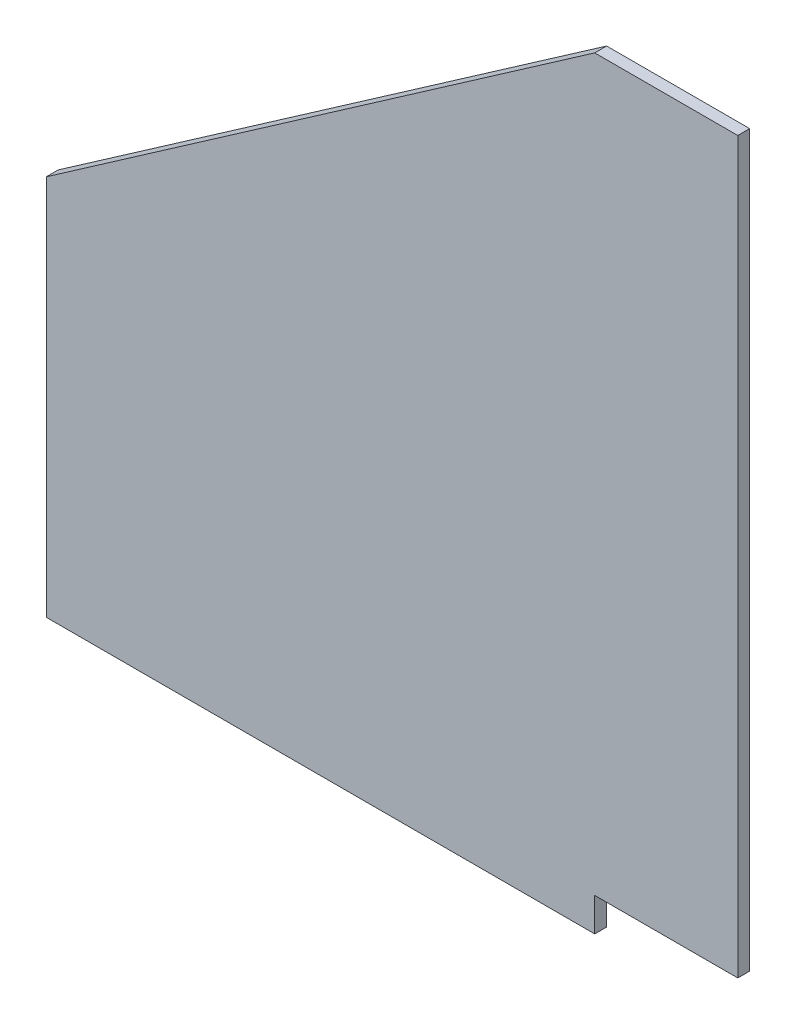
ISO-10303-21;
HEADER;
FILE_DESCRIPTION(('STEP AP214'),'2;1');
FILE_NAME('part.step','',(''),(''),'','','');
FILE_SCHEMA(('AUTOMOTIVE_DESIGN { 1 0 10303 214 1 1 1 1 }'));
ENDSEC;
DATA;
#1=APPLICATION_CONTEXT('core data for automotive mechanical design processes');
#2=APPLICATION_PROTOCOL_DEFINITION('international standard','automotive_design',2000,#1);
#3=PRODUCT_CONTEXT('',#1,'mechanical');
#4=PRODUCT('Part','Part','',(#3));
#5=PRODUCT_RELATED_PRODUCT_CATEGORY('part','',(#4));
#6=PRODUCT_DEFINITION_FORMATION('','',#4);
#7=PRODUCT_DEFINITION_CONTEXT('part definition',#1,'design');
#8=PRODUCT_DEFINITION('design','',#6,#7);
#9=PRODUCT_DEFINITION_SHAPE('','',#8);
#10=(LENGTH_UNIT() NAMED_UNIT(*) SI_UNIT(.MILLI.,.METRE.));
#11=(NAMED_UNIT(*) PLANE_ANGLE_UNIT() SI_UNIT($,.RADIAN.));
#12=(NAMED_UNIT(*) SI_UNIT($,.STERADIAN.) SOLID_ANGLE_UNIT());
#13=UNCERTAINTY_MEASURE_WITH_UNIT(LENGTH_MEASURE(1.E-05),#10,'distance_accuracy_value','');
#14=(GEOMETRIC_REPRESENTATION_CONTEXT(3) GLOBAL_UNCERTAINTY_ASSIGNED_CONTEXT((#13)) GLOBAL_UNIT_ASSIGNED_CONTEXT((#10,
#11,#12)) REPRESENTATION_CONTEXT('',''));
#15=CARTESIAN_POINT('',(0.,0.,0.));
#16=DIRECTION('',(0.,0.,1.));
#17=DIRECTION('',(1.,0.,0.));
#18=AXIS2_PLACEMENT_3D('',#15,#16,#17);
#19=CARTESIAN_POINT('',(-38.1,0.,3.175));
#20=DIRECTION('',(0.,1.,0.));
#21=DIRECTION('',(0.,0.,1.));
#22=AXIS2_PLACEMENT_3D('',#19,#20,#21);
#23=PLANE('',#22);
#24=DIRECTION('',(1.,0.,0.));
#25=VECTOR('',#24,1.);
#26=CARTESIAN_POINT('',(-38.1,0.,0.));
#27=LINE('',#26,#25);
#28=CARTESIAN_POINT('',(-38.1,0.,0.));
#29=VERTEX_POINT('',#28);
#30=CARTESIAN_POINT('',(0.,0.,0.));
#31=VERTEX_POINT('',#30);
#32=EDGE_CURVE('E128',#29,#31,#27,.T.);
#33=ORIENTED_EDGE('',*,*,#32,.T.);
#34=DIRECTION('',(0.,0.,-1.));
#35=VECTOR('',#34,1.);
#36=CARTESIAN_POINT('',(0.,0.,3.175));
#37=LINE('',#36,#35);
#38=CARTESIAN_POINT('',(0.,0.,3.175));
#39=VERTEX_POINT('',#38);
#40=EDGE_CURVE('E11',#39,#31,#37,.T.);
#41=ORIENTED_EDGE('',*,*,#40,.F.);
#42=DIRECTION('',(1.,0.,0.));
#43=VECTOR('',#42,1.);
#44=CARTESIAN_POINT('',(-38.1,0.,3.175));
#45=LINE('',#44,#43);
#46=CARTESIAN_POINT('',(-38.1,0.,3.175));
#47=VERTEX_POINT('',#46);
#48=EDGE_CURVE('E140',#47,#39,#45,.T.);
#49=ORIENTED_EDGE('',*,*,#48,.F.);
#50=DIRECTION('',(0.,0.,-1.));
#51=VECTOR('',#50,1.);
#52=CARTESIAN_POINT('',(-38.1,0.,3.175));
#53=LINE('',#52,#51);
#54=EDGE_CURVE('E124',#47,#29,#53,.T.);
#55=ORIENTED_EDGE('',*,*,#54,.T.);
#56=EDGE_LOOP('',(#33,#41,#49,#55));
#57=FACE_BOUND('',#56,.T.);
#58=ADVANCED_FACE('F38',(#57),#23,.F.);
#59=CARTESIAN_POINT('',(0.,0.,3.175));
#60=DIRECTION('',(-1.,0.,0.));
#61=DIRECTION('',(0.,0.,1.));
#62=AXIS2_PLACEMENT_3D('',#59,#60,#61);
#63=PLANE('',#62);
#64=DIRECTION('',(0.,1.,0.));
#65=VECTOR('',#64,1.);
#66=CARTESIAN_POINT('',(0.,0.,0.));
#67=LINE('',#66,#65);
#68=CARTESIAN_POINT('',(0.,194.31,0.));
#69=VERTEX_POINT('',#68);
#70=EDGE_CURVE('E131',#31,#69,#67,.T.);
#71=ORIENTED_EDGE('',*,*,#70,.T.);
#72=DIRECTION('',(0.,0.,-1.));
#73=VECTOR('',#72,1.);
#74=CARTESIAN_POINT('',(0.,194.31,3.175));
#75=LINE('',#74,#73);
#76=CARTESIAN_POINT('',(0.,194.31,3.175));
#77=VERTEX_POINT('',#76);
#78=EDGE_CURVE('E46',#77,#69,#75,.T.);
#79=ORIENTED_EDGE('',*,*,#78,.F.);
#80=DIRECTION('',(0.,1.,0.));
#81=VECTOR('',#80,1.);
#82=CARTESIAN_POINT('',(0.,0.,3.175));
#83=LINE('',#82,#81);
#84=EDGE_CURVE('E94',#39,#77,#83,.T.);
#85=ORIENTED_EDGE('',*,*,#84,.F.);
#86=ORIENTED_EDGE('',*,*,#40,.T.);
#87=EDGE_LOOP('',(#71,#79,#85,#86));
#88=FACE_BOUND('',#87,.T.);
#89=ADVANCED_FACE('F165',(#88),#63,.F.);
#90=CARTESIAN_POINT('',(0.,194.31,3.175));
#91=DIRECTION('',(0.,-1.,0.));
#92=DIRECTION('',(0.,0.,-1.));
#93=AXIS2_PLACEMENT_3D('',#90,#91,#92);
#94=PLANE('',#93);
#95=DIRECTION('',(-1.,0.,0.));
#96=VECTOR('',#95,1.);
#97=CARTESIAN_POINT('',(0.,194.31,0.));
#98=LINE('',#97,#96);
#99=CARTESIAN_POINT('',(-38.1,194.31,0.));
#100=VERTEX_POINT('',#99);
#101=EDGE_CURVE('E133',#69,#100,#98,.T.);
#102=ORIENTED_EDGE('',*,*,#101,.T.);
#103=DIRECTION('',(0.,0.,-1.));
#104=VECTOR('',#103,1.);
#105=CARTESIAN_POINT('',(-38.1,194.31,3.175));
#106=LINE('',#105,#104);
#107=CARTESIAN_POINT('',(-38.1,194.31,3.175));
#108=VERTEX_POINT('',#107);
#109=EDGE_CURVE('E144',#108,#100,#106,.T.);
#110=ORIENTED_EDGE('',*,*,#109,.F.);
#111=DIRECTION('',(-1.,0.,0.));
#112=VECTOR('',#111,1.);
#113=CARTESIAN_POINT('',(0.,194.31,3.175));
#114=LINE('',#113,#112);
#115=EDGE_CURVE('E152',#77,#108,#114,.T.);
#116=ORIENTED_EDGE('',*,*,#115,.F.);
#117=ORIENTED_EDGE('',*,*,#78,.T.);
#118=EDGE_LOOP('',(#102,#110,#116,#117));
#119=FACE_BOUND('',#118,.T.);
#120=ADVANCED_FACE('F150',(#119),#94,.F.);
#121=CARTESIAN_POINT('',(-184.15,92.71,3.175));
#122=DIRECTION('',(0.5710644881986,-0.820905201785487,0.));
#123=DIRECTION('',(0.820905201785487,0.5710644881986,0.));
#124=AXIS2_PLACEMENT_3D('',#121,#122,#123);
#125=PLANE('',#124);
#126=DIRECTION('',(-0.820905201785487,-0.5710644881986,0.));
#127=VECTOR('',#126,1.);
#128=CARTESIAN_POINT('',(-184.15,92.71,0.));
#129=LINE('',#128,#127);
#130=CARTESIAN_POINT('',(-184.15,92.71,0.));
#131=VERTEX_POINT('',#130);
#132=EDGE_CURVE('E135',#100,#131,#129,.T.);
#133=ORIENTED_EDGE('',*,*,#132,.T.);
#134=DIRECTION('',(0.,0.,-1.));
#135=VECTOR('',#134,1.);
#136=CARTESIAN_POINT('',(-184.15,92.71,3.175));
#137=LINE('',#136,#135);
#138=CARTESIAN_POINT('',(-184.15,92.71,3.175));
#139=VERTEX_POINT('',#138);
#140=EDGE_CURVE('E119',#139,#131,#137,.T.);
#141=ORIENTED_EDGE('',*,*,#140,.F.);
#142=DIRECTION('',(-0.820905201785487,-0.5710644881986,0.));
#143=VECTOR('',#142,1.);
#144=CARTESIAN_POINT('',(-184.15,92.71,3.175));
#145=LINE('',#144,#143);
#146=EDGE_CURVE('E110',#108,#139,#145,.T.);
#147=ORIENTED_EDGE('',*,*,#146,.F.);
#148=ORIENTED_EDGE('',*,*,#109,.T.);
#149=EDGE_LOOP('',(#133,#141,#147,#148));
#150=FACE_BOUND('',#149,.T.);
#151=ADVANCED_FACE('F158',(#150),#125,.F.);
#152=CARTESIAN_POINT('',(-184.15,-8.88999999999997,3.175));
#153=DIRECTION('',(1.,0.,0.));
#154=DIRECTION('',(0.,0.,-1.));
#155=AXIS2_PLACEMENT_3D('',#152,#153,#154);
#156=PLANE('',#155);
#157=DIRECTION('',(0.,-1.,0.));
#158=VECTOR('',#157,1.);
#159=CARTESIAN_POINT('',(-184.15,-8.88999999999997,0.));
#160=LINE('',#159,#158);
#161=CARTESIAN_POINT('',(-184.15,-8.88999999999997,0.));
#162=VERTEX_POINT('',#161);
#163=EDGE_CURVE('E118',#131,#162,#160,.T.);
#164=ORIENTED_EDGE('',*,*,#163,.T.);
#165=DIRECTION('',(0.,0.,-1.));
#166=VECTOR('',#165,1.);
#167=CARTESIAN_POINT('',(-184.15,-8.88999999999997,3.175));
#168=LINE('',#167,#166);
#169=CARTESIAN_POINT('',(-184.15,-8.88999999999997,3.175));
#170=VERTEX_POINT('',#169);
#171=EDGE_CURVE('E115',#170,#162,#168,.T.);
#172=ORIENTED_EDGE('',*,*,#171,.F.);
#173=DIRECTION('',(0.,-1.,0.));
#174=VECTOR('',#173,1.);
#175=CARTESIAN_POINT('',(-184.15,-8.88999999999997,3.175));
#176=LINE('',#175,#174);
#177=EDGE_CURVE('E104',#139,#170,#176,.T.);
#178=ORIENTED_EDGE('',*,*,#177,.F.);
#179=ORIENTED_EDGE('',*,*,#140,.T.);
#180=EDGE_LOOP('',(#164,#172,#178,#179));
#181=FACE_BOUND('',#180,.T.);
#182=ADVANCED_FACE('F116',(#181),#156,.F.);
#183=CARTESIAN_POINT('',(-184.15,-8.88999999999997,3.175));
#184=DIRECTION('',(0.,1.,0.));
#185=DIRECTION('',(0.,0.,1.));
#186=AXIS2_PLACEMENT_3D('',#183,#184,#185);
#187=PLANE('',#186);
#188=DIRECTION('',(1.,0.,0.));
#189=VECTOR('',#188,1.);
#190=CARTESIAN_POINT('',(-184.15,-8.88999999999997,0.));
#191=LINE('',#190,#189);
#192=CARTESIAN_POINT('',(-38.1,-8.88999999999997,0.));
#193=VERTEX_POINT('',#192);
#194=EDGE_CURVE('E80',#162,#193,#191,.T.);
#195=ORIENTED_EDGE('',*,*,#194,.T.);
#196=DIRECTION('',(0.,0.,-1.));
#197=VECTOR('',#196,1.);
#198=CARTESIAN_POINT('',(-38.1,-8.88999999999997,3.175));
#199=LINE('',#198,#197);
#200=CARTESIAN_POINT('',(-38.1,-8.88999999999997,3.175));
#201=VERTEX_POINT('',#200);
#202=EDGE_CURVE('E120',#201,#193,#199,.T.);
#203=ORIENTED_EDGE('',*,*,#202,.F.);
#204=DIRECTION('',(1.,0.,0.));
#205=VECTOR('',#204,1.);
#206=CARTESIAN_POINT('',(-184.15,-8.88999999999997,3.175));
#207=LINE('',#206,#205);
#208=EDGE_CURVE('E108',#170,#201,#207,.T.);
#209=ORIENTED_EDGE('',*,*,#208,.F.);
#210=ORIENTED_EDGE('',*,*,#171,.T.);
#211=EDGE_LOOP('',(#195,#203,#209,#210));
#212=FACE_BOUND('',#211,.T.);
#213=ADVANCED_FACE('F122',(#212),#187,.F.);
#214=CARTESIAN_POINT('',(-38.1,-8.88999999999997,3.175));
#215=DIRECTION('',(-1.,0.,0.));
#216=DIRECTION('',(0.,0.,1.));
#217=AXIS2_PLACEMENT_3D('',#214,#215,#216);
#218=PLANE('',#217);
#219=DIRECTION('',(0.,1.,0.));
#220=VECTOR('',#219,1.);
#221=CARTESIAN_POINT('',(-38.1,-8.88999999999997,0.));
#222=LINE('',#221,#220);
#223=EDGE_CURVE('E86',#193,#29,#222,.T.);
#224=ORIENTED_EDGE('',*,*,#223,.T.);
#225=ORIENTED_EDGE('',*,*,#54,.F.);
#226=DIRECTION('',(0.,1.,0.));
#227=VECTOR('',#226,1.);
#228=CARTESIAN_POINT('',(-38.1,-8.88999999999997,3.175));
#229=LINE('',#228,#227);
#230=EDGE_CURVE('E54',#201,#47,#229,.T.);
#231=ORIENTED_EDGE('',*,*,#230,.F.);
#232=ORIENTED_EDGE('',*,*,#202,.T.);
#233=EDGE_LOOP('',(#224,#225,#231,#232));
#234=FACE_BOUND('',#233,.T.);
#235=ADVANCED_FACE('F179',(#234),#218,.F.);
#236=CARTESIAN_POINT('',(0.,0.,3.175));
#237=DIRECTION('',(0.,0.,1.));
#238=DIRECTION('',(1.,0.,0.));
#239=AXIS2_PLACEMENT_3D('',#236,#237,#238);
#240=PLANE('',#239);
#241=ORIENTED_EDGE('',*,*,#48,.T.);
#242=ORIENTED_EDGE('',*,*,#84,.T.);
#243=ORIENTED_EDGE('',*,*,#115,.T.);
#244=ORIENTED_EDGE('',*,*,#146,.T.);
#245=ORIENTED_EDGE('',*,*,#177,.T.);
#246=ORIENTED_EDGE('',*,*,#208,.T.);
#247=ORIENTED_EDGE('',*,*,#230,.T.);
#248=EDGE_LOOP('',(#241,#242,#243,#244,#245,#246,#247));
#249=FACE_BOUND('',#248,.T.);
#250=ADVANCED_FACE('F106',(#249),#240,.T.);
#251=CARTESIAN_POINT('',(0.,0.,0.));
#252=DIRECTION('',(0.,0.,1.));
#253=DIRECTION('',(1.,0.,0.));
#254=AXIS2_PLACEMENT_3D('',#251,#252,#253);
#255=PLANE('',#254);
#256=ORIENTED_EDGE('',*,*,#32,.F.);
#257=ORIENTED_EDGE('',*,*,#223,.F.);
#258=ORIENTED_EDGE('',*,*,#194,.F.);
#259=ORIENTED_EDGE('',*,*,#163,.F.);
#260=ORIENTED_EDGE('',*,*,#132,.F.);
#261=ORIENTED_EDGE('',*,*,#101,.F.);
#262=ORIENTED_EDGE('',*,*,#70,.F.);
#263=EDGE_LOOP('',(#256,#257,#258,#259,#260,#261,#262));
#264=FACE_BOUND('',#263,.T.);
#265=ADVANCED_FACE('F156',(#264),#255,.F.);
#266=CLOSED_SHELL('',(#58,#89,#120,#151,#182,#213,#235,#250,#265));
#267=MANIFOLD_SOLID_BREP('B2',#266);
#268=ADVANCED_BREP_SHAPE_REPRESENTATION('',(#18,#267),#14);
#269=SHAPE_DEFINITION_REPRESENTATION(#9,#268);
ENDSEC;
END-ISO-10303-21;
